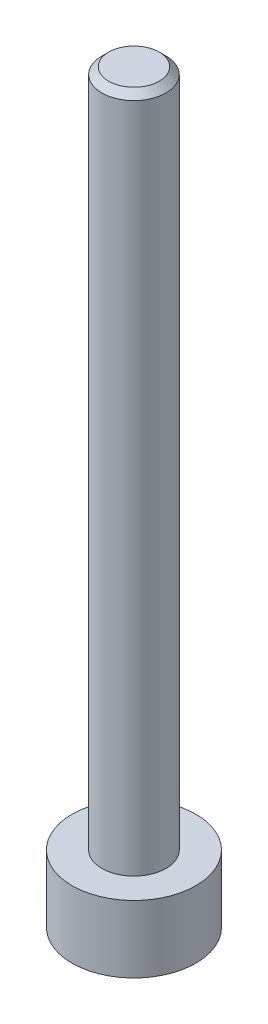
ISO-10303-21;
HEADER;
FILE_DESCRIPTION(('STEP AP214'),'2;1');
FILE_NAME('part.step','',(''),(''),'','','');
FILE_SCHEMA(('AUTOMOTIVE_DESIGN { 1 0 10303 214 1 1 1 1 }'));
ENDSEC;
DATA;
#1=APPLICATION_CONTEXT('core data for automotive mechanical design processes');
#2=APPLICATION_PROTOCOL_DEFINITION('international standard','automotive_design',2000,#1);
#3=PRODUCT_CONTEXT('',#1,'mechanical');
#4=PRODUCT('Part','Part','',(#3));
#5=PRODUCT_RELATED_PRODUCT_CATEGORY('part','',(#4));
#6=PRODUCT_DEFINITION_FORMATION('','',#4);
#7=PRODUCT_DEFINITION_CONTEXT('part definition',#1,'design');
#8=PRODUCT_DEFINITION('design','',#6,#7);
#9=PRODUCT_DEFINITION_SHAPE('','',#8);
#10=(LENGTH_UNIT() NAMED_UNIT(*) SI_UNIT(.MILLI.,.METRE.));
#11=(NAMED_UNIT(*) PLANE_ANGLE_UNIT() SI_UNIT($,.RADIAN.));
#12=(NAMED_UNIT(*) SI_UNIT($,.STERADIAN.) SOLID_ANGLE_UNIT());
#13=UNCERTAINTY_MEASURE_WITH_UNIT(LENGTH_MEASURE(1.E-05),#10,'distance_accuracy_value','');
#14=(GEOMETRIC_REPRESENTATION_CONTEXT(3) GLOBAL_UNCERTAINTY_ASSIGNED_CONTEXT((#13)) GLOBAL_UNIT_ASSIGNED_CONTEXT((#10,
#11,#12)) REPRESENTATION_CONTEXT('',''));
#15=CARTESIAN_POINT('',(0.,0.,0.));
#16=DIRECTION('',(0.,0.,1.));
#17=DIRECTION('',(1.,0.,0.));
#18=AXIS2_PLACEMENT_3D('',#15,#16,#17);
#19=CARTESIAN_POINT('',(0.,1.98,0.));
#20=DIRECTION('',(0.,-1.,0.));
#21=DIRECTION('',(0.,0.,-1.));
#22=AXIS2_PLACEMENT_3D('',#19,#20,#21);
#23=CYLINDRICAL_SURFACE('',#22,1.825);
#24=CARTESIAN_POINT('',(0.,1.98,0.));
#25=DIRECTION('',(0.,1.,0.));
#26=DIRECTION('',(0.,0.,1.));
#27=AXIS2_PLACEMENT_3D('',#24,#25,#26);
#28=CIRCLE('',#27,1.825);
#29=CARTESIAN_POINT('',(0.,1.98,1.825));
#30=VERTEX_POINT('',#29);
#31=EDGE_CURVE('E176',#30,#30,#28,.T.);
#32=ORIENTED_EDGE('',*,*,#31,.F.);
#33=EDGE_LOOP('',(#32));
#34=FACE_BOUND('',#33,.T.);
#35=CARTESIAN_POINT('',(0.,0.,0.));
#36=DIRECTION('',(0.,1.,0.));
#37=DIRECTION('',(0.,0.,1.));
#38=AXIS2_PLACEMENT_3D('',#35,#36,#37);
#39=CIRCLE('',#38,1.825);
#40=CARTESIAN_POINT('',(0.,0.,1.825));
#41=VERTEX_POINT('',#40);
#42=EDGE_CURVE('E162',#41,#41,#39,.T.);
#43=ORIENTED_EDGE('',*,*,#42,.T.);
#44=EDGE_LOOP('',(#43));
#45=FACE_BOUND('',#44,.T.);
#46=ADVANCED_FACE('F46',(#34,#45),#23,.T.);
#47=CARTESIAN_POINT('',(0.,1.98,0.));
#48=DIRECTION('',(0.,1.,0.));
#49=DIRECTION('',(0.,0.,1.));
#50=AXIS2_PLACEMENT_3D('',#47,#48,#49);
#51=PLANE('',#50);
#52=CARTESIAN_POINT('',(0.,1.98,0.));
#53=DIRECTION('',(0.,1.,0.));
#54=DIRECTION('',(0.,0.,1.));
#55=AXIS2_PLACEMENT_3D('',#52,#53,#54);
#56=CIRCLE('',#55,0.945);
#57=CARTESIAN_POINT('',(0.,1.98,0.945));
#58=VERTEX_POINT('',#57);
#59=EDGE_CURVE('E172',#58,#58,#56,.T.);
#60=ORIENTED_EDGE('',*,*,#59,.F.);
#61=EDGE_LOOP('',(#60));
#62=FACE_BOUND('',#61,.T.);
#63=ORIENTED_EDGE('',*,*,#31,.T.);
#64=EDGE_LOOP('',(#63));
#65=FACE_BOUND('',#64,.T.);
#66=ADVANCED_FACE('F198',(#62,#65),#51,.T.);
#67=CARTESIAN_POINT('',(0.,0.,0.));
#68=DIRECTION('',(0.,1.,0.));
#69=DIRECTION('',(0.,0.,1.));
#70=AXIS2_PLACEMENT_3D('',#67,#68,#69);
#71=PLANE('',#70);
#72=DIRECTION('',(0.5,0.,0.866025403784439));
#73=VECTOR('',#72,1.);
#74=CARTESIAN_POINT('',(0.458993464005752,0.,-0.795));
#75=LINE('',#74,#73);
#76=CARTESIAN_POINT('',(0.458993464005752,0.,-0.795));
#77=VERTEX_POINT('',#76);
#78=CARTESIAN_POINT('',(0.917986928011505,0.,0.));
#79=VERTEX_POINT('',#78);
#80=EDGE_CURVE('E143',#77,#79,#75,.T.);
#81=ORIENTED_EDGE('',*,*,#80,.F.);
#82=DIRECTION('',(1.,0.,0.));
#83=VECTOR('',#82,1.);
#84=CARTESIAN_POINT('',(-0.458993464005752,0.,-0.795));
#85=LINE('',#84,#83);
#86=CARTESIAN_POINT('',(-0.458993464005752,0.,-0.795));
#87=VERTEX_POINT('',#86);
#88=EDGE_CURVE('E63',#87,#77,#85,.T.);
#89=ORIENTED_EDGE('',*,*,#88,.F.);
#90=DIRECTION('',(0.5,0.,-0.866025403784439));
#91=VECTOR('',#90,1.);
#92=CARTESIAN_POINT('',(-0.917986928011505,0.,0.));
#93=LINE('',#92,#91);
#94=CARTESIAN_POINT('',(-0.917986928011505,0.,0.));
#95=VERTEX_POINT('',#94);
#96=EDGE_CURVE('E156',#95,#87,#93,.T.);
#97=ORIENTED_EDGE('',*,*,#96,.F.);
#98=DIRECTION('',(-0.5,0.,-0.866025403784439));
#99=VECTOR('',#98,1.);
#100=CARTESIAN_POINT('',(-0.458993464005753,0.,0.795));
#101=LINE('',#100,#99);
#102=CARTESIAN_POINT('',(-0.458993464005753,0.,0.795));
#103=VERTEX_POINT('',#102);
#104=EDGE_CURVE('E153',#103,#95,#101,.T.);
#105=ORIENTED_EDGE('',*,*,#104,.F.);
#106=DIRECTION('',(-1.,0.,0.));
#107=VECTOR('',#106,1.);
#108=CARTESIAN_POINT('',(0.458993464005752,0.,0.795));
#109=LINE('',#108,#107);
#110=CARTESIAN_POINT('',(0.458993464005752,0.,0.795));
#111=VERTEX_POINT('',#110);
#112=EDGE_CURVE('E111',#111,#103,#109,.T.);
#113=ORIENTED_EDGE('',*,*,#112,.F.);
#114=DIRECTION('',(-0.5,0.,0.866025403784438));
#115=VECTOR('',#114,1.);
#116=CARTESIAN_POINT('',(0.917986928011505,0.,0.));
#117=LINE('',#116,#115);
#118=EDGE_CURVE('E147',#79,#111,#117,.T.);
#119=ORIENTED_EDGE('',*,*,#118,.F.);
#120=EDGE_LOOP('',(#81,#89,#97,#105,#113,#119));
#121=FACE_BOUND('',#120,.T.);
#122=ORIENTED_EDGE('',*,*,#42,.F.);
#123=EDGE_LOOP('',(#122));
#124=FACE_BOUND('',#123,.T.);
#125=ADVANCED_FACE('F203',(#121,#124),#71,.F.);
#126=CARTESIAN_POINT('',(0.,21.98,0.));
#127=DIRECTION('',(0.,-1.,0.));
#128=DIRECTION('',(0.,0.,-1.));
#129=AXIS2_PLACEMENT_3D('',#126,#127,#128);
#130=CYLINDRICAL_SURFACE('',#129,0.945);
#131=CARTESIAN_POINT('',(0.,21.78,0.));
#132=DIRECTION('',(0.,1.,0.));
#133=DIRECTION('',(0.,0.,1.));
#134=AXIS2_PLACEMENT_3D('',#131,#132,#133);
#135=CIRCLE('',#134,0.945);
#136=CARTESIAN_POINT('',(0.,21.78,0.945));
#137=VERTEX_POINT('',#136);
#138=EDGE_CURVE('E11',#137,#137,#135,.F.);
#139=ORIENTED_EDGE('',*,*,#138,.T.);
#140=EDGE_LOOP('',(#139));
#141=FACE_BOUND('',#140,.T.);
#142=ORIENTED_EDGE('',*,*,#59,.T.);
#143=EDGE_LOOP('',(#142));
#144=FACE_BOUND('',#143,.T.);
#145=ADVANCED_FACE('F210',(#141,#144),#130,.T.);
#146=CARTESIAN_POINT('',(0.,21.98,0.));
#147=DIRECTION('',(0.,1.,0.));
#148=DIRECTION('',(0.,0.,1.));
#149=AXIS2_PLACEMENT_3D('',#146,#147,#148);
#150=PLANE('',#149);
#151=CARTESIAN_POINT('',(0.,21.98,0.));
#152=DIRECTION('',(0.,1.,0.));
#153=DIRECTION('',(0.,0.,1.));
#154=AXIS2_PLACEMENT_3D('',#151,#152,#153);
#155=CIRCLE('',#154,0.744999999999999);
#156=CARTESIAN_POINT('',(0.,21.98,0.744999999999999));
#157=VERTEX_POINT('',#156);
#158=EDGE_CURVE('E56',#157,#157,#155,.T.);
#159=ORIENTED_EDGE('',*,*,#158,.T.);
#160=EDGE_LOOP('',(#159));
#161=FACE_BOUND('',#160,.T.);
#162=ADVANCED_FACE('F186',(#161),#150,.T.);
#163=CARTESIAN_POINT('',(-0.458993464005752,1.,-0.795));
#164=DIRECTION('',(0.,0.,-1.));
#165=DIRECTION('',(-1.,0.,0.));
#166=AXIS2_PLACEMENT_3D('',#163,#164,#165);
#167=PLANE('',#166);
#168=ORIENTED_EDGE('',*,*,#88,.T.);
#169=DIRECTION('',(0.,-1.,0.));
#170=VECTOR('',#169,1.);
#171=CARTESIAN_POINT('',(0.458993464005752,1.,-0.795));
#172=LINE('',#171,#170);
#173=CARTESIAN_POINT('',(0.458993464005752,1.,-0.795));
#174=VERTEX_POINT('',#173);
#175=EDGE_CURVE('E93',#174,#77,#172,.T.);
#176=ORIENTED_EDGE('',*,*,#175,.F.);
#177=DIRECTION('',(1.,0.,0.));
#178=VECTOR('',#177,1.);
#179=CARTESIAN_POINT('',(-0.458993464005752,1.,-0.795));
#180=LINE('',#179,#178);
#181=CARTESIAN_POINT('',(-0.458993464005752,1.,-0.795));
#182=VERTEX_POINT('',#181);
#183=EDGE_CURVE('E159',#182,#174,#180,.T.);
#184=ORIENTED_EDGE('',*,*,#183,.F.);
#185=DIRECTION('',(0.,-1.,0.));
#186=VECTOR('',#185,1.);
#187=CARTESIAN_POINT('',(-0.458993464005752,1.,-0.795));
#188=LINE('',#187,#186);
#189=EDGE_CURVE('E71',#182,#87,#188,.T.);
#190=ORIENTED_EDGE('',*,*,#189,.T.);
#191=EDGE_LOOP('',(#168,#176,#184,#190));
#192=FACE_BOUND('',#191,.T.);
#193=ADVANCED_FACE('F217',(#192),#167,.F.);
#194=CARTESIAN_POINT('',(-0.917986928011505,1.,0.));
#195=DIRECTION('',(-0.866025403784439,0.,-0.5));
#196=DIRECTION('',(-0.5,0.,0.866025403784439));
#197=AXIS2_PLACEMENT_3D('',#194,#195,#196);
#198=PLANE('',#197);
#199=ORIENTED_EDGE('',*,*,#96,.T.);
#200=ORIENTED_EDGE('',*,*,#189,.F.);
#201=DIRECTION('',(0.5,0.,-0.866025403784439));
#202=VECTOR('',#201,1.);
#203=CARTESIAN_POINT('',(-0.917986928011505,1.,0.));
#204=LINE('',#203,#202);
#205=CARTESIAN_POINT('',(-0.917986928011505,1.,0.));
#206=VERTEX_POINT('',#205);
#207=EDGE_CURVE('E125',#206,#182,#204,.T.);
#208=ORIENTED_EDGE('',*,*,#207,.F.);
#209=DIRECTION('',(0.,-1.,0.));
#210=VECTOR('',#209,1.);
#211=CARTESIAN_POINT('',(-0.917986928011505,1.,0.));
#212=LINE('',#211,#210);
#213=EDGE_CURVE('E116',#206,#95,#212,.T.);
#214=ORIENTED_EDGE('',*,*,#213,.T.);
#215=EDGE_LOOP('',(#199,#200,#208,#214));
#216=FACE_BOUND('',#215,.T.);
#217=ADVANCED_FACE('F220',(#216),#198,.F.);
#218=CARTESIAN_POINT('',(-0.458993464005753,1.,0.795));
#219=DIRECTION('',(-0.866025403784439,0.,0.5));
#220=DIRECTION('',(0.5,0.,0.866025403784439));
#221=AXIS2_PLACEMENT_3D('',#218,#219,#220);
#222=PLANE('',#221);
#223=ORIENTED_EDGE('',*,*,#104,.T.);
#224=ORIENTED_EDGE('',*,*,#213,.F.);
#225=DIRECTION('',(-0.5,0.,-0.866025403784439));
#226=VECTOR('',#225,1.);
#227=CARTESIAN_POINT('',(-0.458993464005753,1.,0.795));
#228=LINE('',#227,#226);
#229=CARTESIAN_POINT('',(-0.458993464005753,1.,0.795));
#230=VERTEX_POINT('',#229);
#231=EDGE_CURVE('E120',#230,#206,#228,.T.);
#232=ORIENTED_EDGE('',*,*,#231,.F.);
#233=DIRECTION('',(0.,-1.,0.));
#234=VECTOR('',#233,1.);
#235=CARTESIAN_POINT('',(-0.458993464005753,1.,0.795));
#236=LINE('',#235,#234);
#237=EDGE_CURVE('E104',#230,#103,#236,.T.);
#238=ORIENTED_EDGE('',*,*,#237,.T.);
#239=EDGE_LOOP('',(#223,#224,#232,#238));
#240=FACE_BOUND('',#239,.T.);
#241=ADVANCED_FACE('F121',(#240),#222,.F.);
#242=CARTESIAN_POINT('',(0.458993464005752,1.,0.795));
#243=DIRECTION('',(0.,0.,1.));
#244=DIRECTION('',(1.,0.,0.));
#245=AXIS2_PLACEMENT_3D('',#242,#243,#244);
#246=PLANE('',#245);
#247=ORIENTED_EDGE('',*,*,#112,.T.);
#248=ORIENTED_EDGE('',*,*,#237,.F.);
#249=DIRECTION('',(-1.,0.,0.));
#250=VECTOR('',#249,1.);
#251=CARTESIAN_POINT('',(0.458993464005752,1.,0.795));
#252=LINE('',#251,#250);
#253=CARTESIAN_POINT('',(0.458993464005752,1.,0.795));
#254=VERTEX_POINT('',#253);
#255=EDGE_CURVE('E108',#254,#230,#252,.T.);
#256=ORIENTED_EDGE('',*,*,#255,.F.);
#257=DIRECTION('',(0.,-1.,0.));
#258=VECTOR('',#257,1.);
#259=CARTESIAN_POINT('',(0.458993464005752,1.,0.795));
#260=LINE('',#259,#258);
#261=EDGE_CURVE('E117',#254,#111,#260,.T.);
#262=ORIENTED_EDGE('',*,*,#261,.T.);
#263=EDGE_LOOP('',(#247,#248,#256,#262));
#264=FACE_BOUND('',#263,.T.);
#265=ADVANCED_FACE('F106',(#264),#246,.F.);
#266=CARTESIAN_POINT('',(0.917986928011505,1.,0.));
#267=DIRECTION('',(0.866025403784438,0.,0.5));
#268=DIRECTION('',(0.5,0.,-0.866025403784439));
#269=AXIS2_PLACEMENT_3D('',#266,#267,#268);
#270=PLANE('',#269);
#271=ORIENTED_EDGE('',*,*,#118,.T.);
#272=ORIENTED_EDGE('',*,*,#261,.F.);
#273=DIRECTION('',(-0.5,0.,0.866025403784438));
#274=VECTOR('',#273,1.);
#275=CARTESIAN_POINT('',(0.917986928011505,1.,0.));
#276=LINE('',#275,#274);
#277=CARTESIAN_POINT('',(0.917986928011505,1.,0.));
#278=VERTEX_POINT('',#277);
#279=EDGE_CURVE('E131',#278,#254,#276,.T.);
#280=ORIENTED_EDGE('',*,*,#279,.F.);
#281=DIRECTION('',(0.,-1.,0.));
#282=VECTOR('',#281,1.);
#283=CARTESIAN_POINT('',(0.917986928011505,1.,0.));
#284=LINE('',#283,#282);
#285=EDGE_CURVE('E167',#278,#79,#284,.T.);
#286=ORIENTED_EDGE('',*,*,#285,.T.);
#287=EDGE_LOOP('',(#271,#272,#280,#286));
#288=FACE_BOUND('',#287,.T.);
#289=ADVANCED_FACE('F223',(#288),#270,.F.);
#290=CARTESIAN_POINT('',(0.458993464005752,1.,-0.795));
#291=DIRECTION('',(0.866025403784439,0.,-0.5));
#292=DIRECTION('',(-0.5,0.,-0.866025403784439));
#293=AXIS2_PLACEMENT_3D('',#290,#291,#292);
#294=PLANE('',#293);
#295=ORIENTED_EDGE('',*,*,#80,.T.);
#296=ORIENTED_EDGE('',*,*,#285,.F.);
#297=DIRECTION('',(0.5,0.,0.866025403784439));
#298=VECTOR('',#297,1.);
#299=CARTESIAN_POINT('',(0.458993464005752,1.,-0.795));
#300=LINE('',#299,#298);
#301=EDGE_CURVE('E135',#174,#278,#300,.T.);
#302=ORIENTED_EDGE('',*,*,#301,.F.);
#303=ORIENTED_EDGE('',*,*,#175,.T.);
#304=EDGE_LOOP('',(#295,#296,#302,#303));
#305=FACE_BOUND('',#304,.T.);
#306=ADVANCED_FACE('F194',(#305),#294,.F.);
#307=CARTESIAN_POINT('',(0.,1.,0.));
#308=DIRECTION('',(0.,-1.,0.));
#309=DIRECTION('',(0.,0.,-1.));
#310=AXIS2_PLACEMENT_3D('',#307,#308,#309);
#311=PLANE('',#310);
#312=ORIENTED_EDGE('',*,*,#183,.T.);
#313=ORIENTED_EDGE('',*,*,#301,.T.);
#314=ORIENTED_EDGE('',*,*,#279,.T.);
#315=ORIENTED_EDGE('',*,*,#255,.T.);
#316=ORIENTED_EDGE('',*,*,#231,.T.);
#317=ORIENTED_EDGE('',*,*,#207,.T.);
#318=EDGE_LOOP('',(#312,#313,#314,#315,#316,#317));
#319=FACE_BOUND('',#318,.T.);
#320=ADVANCED_FACE('F128',(#319),#311,.T.);
#321=CARTESIAN_POINT('',(0.,21.98,0.));
#322=DIRECTION('',(0.,-1.,0.));
#323=DIRECTION('',(0.,0.,-1.));
#324=AXIS2_PLACEMENT_3D('',#321,#322,#323);
#325=CONICAL_SURFACE('',#324,0.744999999999999,0.785398163397445);
#326=ORIENTED_EDGE('',*,*,#138,.F.);
#327=EDGE_LOOP('',(#326));
#328=FACE_BOUND('',#327,.T.);
#329=ORIENTED_EDGE('',*,*,#158,.F.);
#330=EDGE_LOOP('',(#329));
#331=FACE_BOUND('',#330,.T.);
#332=ADVANCED_FACE('F49',(#328,#331),#325,.T.);
#333=CLOSED_SHELL('',(#46,#66,#125,#145,#162,#193,#217,#241,#265,#289,#306,#320,#332));
#334=MANIFOLD_SOLID_BREP('B2',#333);
#335=ADVANCED_BREP_SHAPE_REPRESENTATION('',(#18,#334),#14);
#336=SHAPE_DEFINITION_REPRESENTATION(#9,#335);
ENDSEC;
END-ISO-10303-21;
